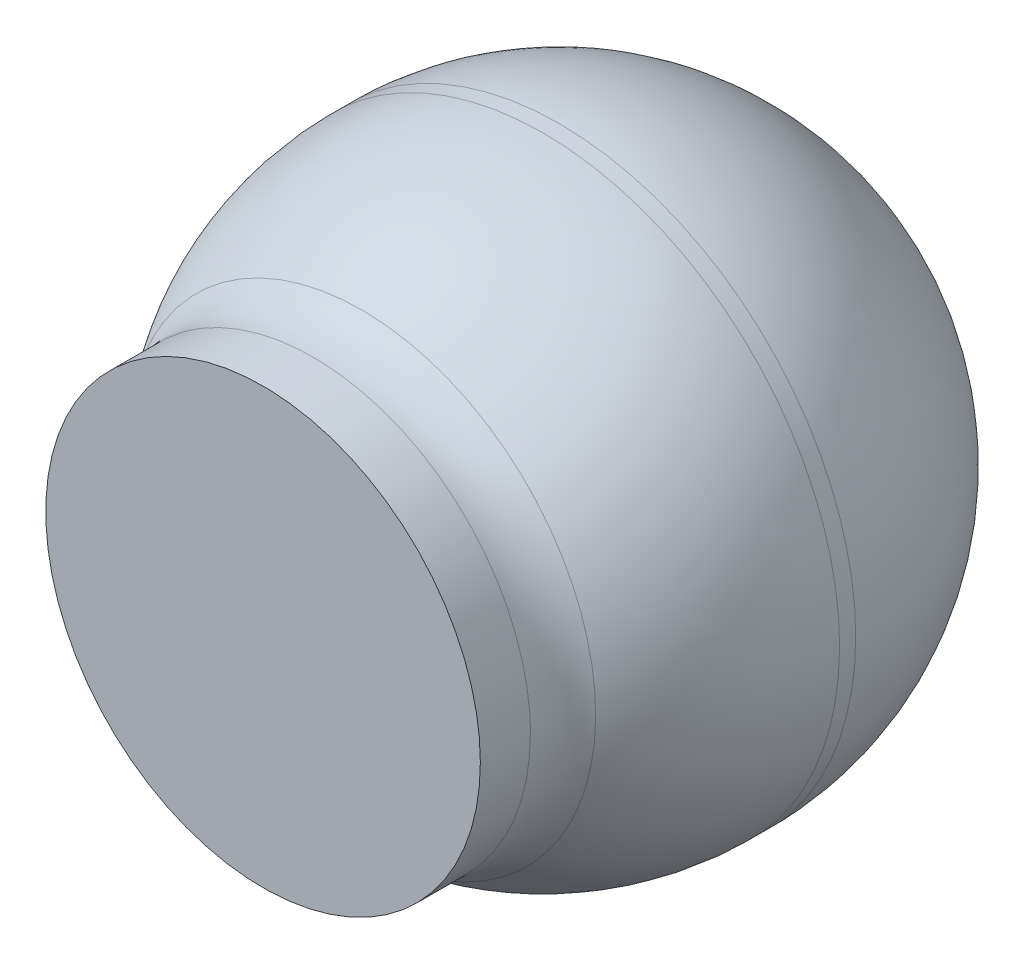
ISO-10303-21;
HEADER;
FILE_DESCRIPTION(('STEP AP214'),'2;1');
FILE_NAME('part.step','',(''),(''),'','','');
FILE_SCHEMA(('AUTOMOTIVE_DESIGN { 1 0 10303 214 1 1 1 1 }'));
ENDSEC;
DATA;
#1=APPLICATION_CONTEXT('core data for automotive mechanical design processes');
#2=APPLICATION_PROTOCOL_DEFINITION('international standard','automotive_design',2000,#1);
#3=PRODUCT_CONTEXT('',#1,'mechanical');
#4=PRODUCT('Part','Part','',(#3));
#5=PRODUCT_RELATED_PRODUCT_CATEGORY('part','',(#4));
#6=PRODUCT_DEFINITION_FORMATION('','',#4);
#7=PRODUCT_DEFINITION_CONTEXT('part definition',#1,'design');
#8=PRODUCT_DEFINITION('design','',#6,#7);
#9=PRODUCT_DEFINITION_SHAPE('','',#8);
#10=(LENGTH_UNIT() NAMED_UNIT(*) SI_UNIT(.MILLI.,.METRE.));
#11=(NAMED_UNIT(*) PLANE_ANGLE_UNIT() SI_UNIT($,.RADIAN.));
#12=(NAMED_UNIT(*) SI_UNIT($,.STERADIAN.) SOLID_ANGLE_UNIT());
#13=UNCERTAINTY_MEASURE_WITH_UNIT(LENGTH_MEASURE(1.E-05),#10,'distance_accuracy_value','');
#14=(GEOMETRIC_REPRESENTATION_CONTEXT(3) GLOBAL_UNCERTAINTY_ASSIGNED_CONTEXT((#13)) GLOBAL_UNIT_ASSIGNED_CONTEXT((#10,
#11,#12)) REPRESENTATION_CONTEXT('',''));
#15=CARTESIAN_POINT('',(0.,0.,0.));
#16=DIRECTION('',(0.,0.,1.));
#17=DIRECTION('',(1.,0.,0.));
#18=AXIS2_PLACEMENT_3D('',#15,#16,#17);
#19=CARTESIAN_POINT('',(-4.372919922269,-0.241349291452,10.006534503384));
#20=DIRECTION('',(0.,0.,-1.));
#21=DIRECTION('',(-1.,0.,0.));
#22=AXIS2_PLACEMENT_3D('',#19,#20,#21);
#23=PLANE('',#22);
#24=CARTESIAN_POINT('',(-4.372919922269,-0.241349291452,10.006534503384));
#25=DIRECTION('',(0.,0.,1.));
#26=DIRECTION('',(1.,0.,0.));
#27=AXIS2_PLACEMENT_3D('',#24,#25,#26);
#28=CIRCLE('',#27,0.275);
#29=CARTESIAN_POINT('',(-4.097919922269,-0.241349291452,10.006534503384));
#30=VERTEX_POINT('',#29);
#31=EDGE_CURVE('E20',#30,#30,#28,.F.);
#32=ORIENTED_EDGE('',*,*,#31,.F.);
#33=EDGE_LOOP('',(#32));
#34=FACE_BOUND('',#33,.T.);
#35=ADVANCED_FACE('F17',(#34),#23,.F.);
#36=CARTESIAN_POINT('',(-4.372919922269,-0.241349291452,9.906534503384));
#37=DIRECTION('',(0.,0.,1.));
#38=DIRECTION('',(1.,0.,0.));
#39=AXIS2_PLACEMENT_3D('',#36,#37,#38);
#40=CYLINDRICAL_SURFACE('',#39,0.275);
#41=CARTESIAN_POINT('',(-4.372919922269,-0.241349291452,9.943180457728));
#42=DIRECTION('',(0.,0.,-1.));
#43=DIRECTION('',(0.996700902337582,0.0811622527992461,0.));
#44=AXIS2_PLACEMENT_3D('',#41,#42,#43);
#45=CIRCLE('',#44,0.275);
#46=CARTESIAN_POINT('',(-4.09882717412617,-0.219029671932207,9.943180457728));
#47=VERTEX_POINT('',#46);
#48=EDGE_CURVE('E65',#47,#47,#45,.F.);
#49=ORIENTED_EDGE('',*,*,#48,.T.);
#50=EDGE_LOOP('',(#49));
#51=FACE_BOUND('',#50,.T.);
#52=ORIENTED_EDGE('',*,*,#31,.T.);
#53=EDGE_LOOP('',(#52));
#54=FACE_BOUND('',#53,.T.);
#55=ADVANCED_FACE('F62',(#51,#54),#40,.T.);
#56=CARTESIAN_POINT('',(-4.372919922269,-0.241349291452,9.943180457728));
#57=DIRECTION('',(0.,0.,-1.));
#58=DIRECTION('',(0.996700902337583,0.081162252799246,0.));
#59=AXIS2_PLACEMENT_3D('',#56,#57,#58);
#60=TOROIDAL_SURFACE('',#59,0.375,0.1);
#61=ORIENTED_EDGE('',*,*,#48,.F.);
#62=EDGE_LOOP('',(#61));
#63=FACE_BOUND('',#62,.T.);
#64=CARTESIAN_POINT('',(-4.372919922269,-0.241349291452,9.881744931236));
#65=DIRECTION('',(0.,0.,-1.));
#66=DIRECTION('',(-0.996700902337598,-0.0811622527990607,0.));
#67=AXIS2_PLACEMENT_3D('',#64,#65,#66);
#68=CIRCLE('',#67,0.296097046412665);
#69=CARTESIAN_POINT('',(-4.668040115608,-0.265381194786,9.881744931236));
#70=VERTEX_POINT('',#69);
#71=EDGE_CURVE('E39',#70,#70,#68,.T.);
#72=ORIENTED_EDGE('',*,*,#71,.F.);
#73=EDGE_LOOP('',(#72));
#74=FACE_BOUND('',#73,.T.);
#75=ADVANCED_FACE('F57',(#63,#74),#60,.F.);
#76=CARTESIAN_POINT('',(-4.746682760645,-0.271785136252,9.651976062157));
#77=CARTESIAN_POINT('',(-4.746682760645,-0.271785136252,9.701461392103));
#78=CARTESIAN_POINT('',(-4.738526217348,-0.271120941579,9.750947004335));
#79=CARTESIAN_POINT('',(-4.722207085349,-0.269792059952,9.798626332798));
#80=CARTESIAN_POINT('',(-4.698341390838,-0.267848654938,9.842699544317));
#81=CARTESIAN_POINT('',(-4.668040115608,-0.265381194786,9.881744931236));
#82=(BOUNDED_CURVE() B_SPLINE_CURVE(5,(#76,#77,#78,#79,#80,#81),.UNSPECIFIED.,.F.,
.F.) B_SPLINE_CURVE_WITH_KNOTS((6,6),(0.,0.661568582165),
.UNSPECIFIED.) CURVE() GEOMETRIC_REPRESENTATION_ITEM() RATIONAL_B_SPLINE_CURVE((1.,1.,1.,1.,1.,1.)) REPRESENTATION_ITEM(''));
#83=CARTESIAN_POINT('',(-4.372919922269,-0.241349291452,9.651976062157));
#84=DIRECTION('',(0.,0.,-1.));
#85=AXIS1_PLACEMENT('',#83,#84);
#86=SURFACE_OF_REVOLUTION('',#82,#85);
#87=CARTESIAN_POINT('',(-4.372919922269,-0.241349291452,9.651976062157));
#88=DIRECTION('',(0.,0.,1.));
#89=DIRECTION('',(1.,0.,0.));
#90=AXIS2_PLACEMENT_3D('',#87,#88,#89);
#91=CIRCLE('',#90,0.375);
#92=CARTESIAN_POINT('',(-3.997919922269,-0.241349291452,9.651976062157));
#93=VERTEX_POINT('',#92);
#94=EDGE_CURVE('E36',#93,#93,#91,.F.);
#95=ORIENTED_EDGE('',*,*,#94,.F.);
#96=EDGE_LOOP('',(#95));
#97=FACE_BOUND('',#96,.T.);
#98=ORIENTED_EDGE('',*,*,#71,.T.);
#99=EDGE_LOOP('',(#98));
#100=FACE_BOUND('',#99,.T.);
#101=ADVANCED_FACE('F53',(#97,#100),#86,.F.);
#102=CARTESIAN_POINT('',(-4.372919922269,-0.241349291452,9.256534503384));
#103=DIRECTION('',(0.,0.,1.));
#104=DIRECTION('',(1.,0.,0.));
#105=AXIS2_PLACEMENT_3D('',#102,#103,#104);
#106=CYLINDRICAL_SURFACE('',#105,0.375);
#107=CARTESIAN_POINT('',(-4.372919922269,-0.241349291452,9.631534503384));
#108=DIRECTION('',(0.,0.,-1.));
#109=DIRECTION('',(0.0811622527992356,-0.996700902337583,0.));
#110=AXIS2_PLACEMENT_3D('',#107,#108,#109);
#111=CIRCLE('',#110,0.375);
#112=CARTESIAN_POINT('',(-4.34248407746929,-0.615112129828594,9.631534503384));
#113=VERTEX_POINT('',#112);
#114=CARTESIAN_POINT('',(-4.40335576706871,0.132413546924594,9.631534503384));
#115=VERTEX_POINT('',#114);
#116=EDGE_CURVE('E11',#113,#115,#111,.T.);
#117=ORIENTED_EDGE('',*,*,#116,.F.);
#118=CARTESIAN_POINT('',(-4.372919922269,-0.241349291452,9.631534503384));
#119=DIRECTION('',(0.,0.,1.));
#120=DIRECTION('',(0.0811622527992365,-0.996700902337583,0.));
#121=AXIS2_PLACEMENT_3D('',#118,#119,#120);
#122=CIRCLE('',#121,0.375);
#123=EDGE_CURVE('E25',#115,#113,#122,.F.);
#124=ORIENTED_EDGE('',*,*,#123,.F.);
#125=EDGE_LOOP('',(#117,#124));
#126=FACE_BOUND('',#125,.T.);
#127=ORIENTED_EDGE('',*,*,#94,.T.);
#128=EDGE_LOOP('',(#127));
#129=FACE_BOUND('',#128,.T.);
#130=ADVANCED_FACE('F34',(#126,#129),#106,.T.);
#131=CARTESIAN_POINT('',(-4.372919922269,-0.241349291452,9.631534503384));
#132=DIRECTION('',(0.0811622527992361,-0.996700902337583,0.));
#133=DIRECTION('',(-0.996700902337583,-0.0811622527992361,0.));
#134=AXIS2_PLACEMENT_3D('',#131,#132,#133);
#135=SPHERICAL_SURFACE('',#134,0.375);
#136=ORIENTED_EDGE('',*,*,#123,.T.);
#137=ORIENTED_EDGE('',*,*,#116,.T.);
#138=EDGE_LOOP('',(#136,#137));
#139=FACE_BOUND('',#138,.T.);
#140=ADVANCED_FACE('F32',(#139),#135,.T.);
#141=CLOSED_SHELL('',(#35,#55,#75,#101,#130,#140));
#142=MANIFOLD_SOLID_BREP('B1',#141);
#143=ADVANCED_BREP_SHAPE_REPRESENTATION('',(#18,#142),#14);
#144=SHAPE_DEFINITION_REPRESENTATION(#9,#143);
ENDSEC;
END-ISO-10303-21;
